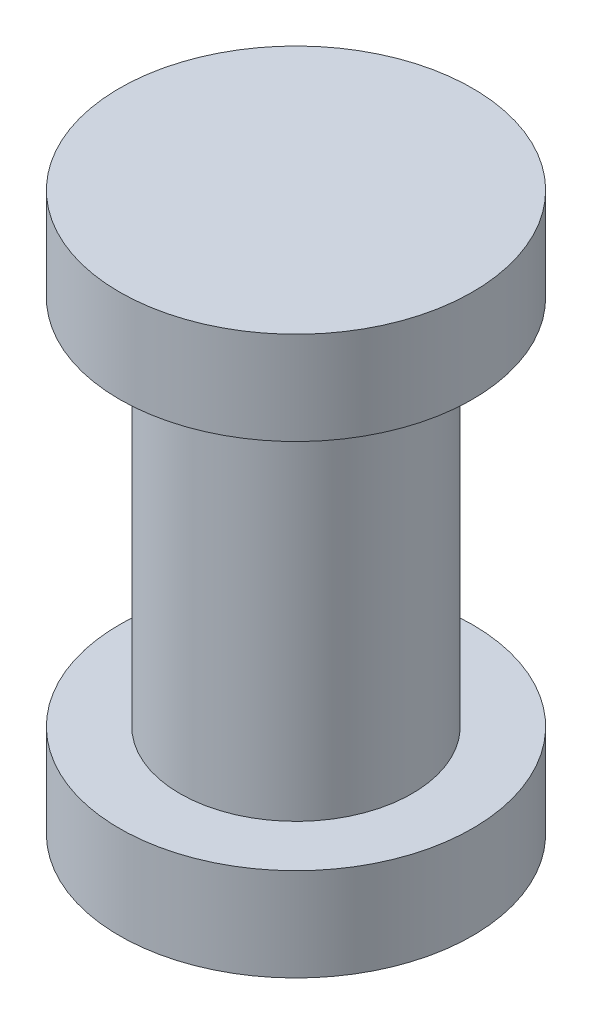
ISO-10303-21;
HEADER;
FILE_DESCRIPTION(('STEP AP214'),'2;1');
FILE_NAME('part.step','',(''),(''),'','','');
FILE_SCHEMA(('AUTOMOTIVE_DESIGN { 1 0 10303 214 1 1 1 1 }'));
ENDSEC;
DATA;
#1=APPLICATION_CONTEXT('core data for automotive mechanical design processes');
#2=APPLICATION_PROTOCOL_DEFINITION('international standard','automotive_design',2000,#1);
#3=PRODUCT_CONTEXT('',#1,'mechanical');
#4=PRODUCT('Part','Part','',(#3));
#5=PRODUCT_RELATED_PRODUCT_CATEGORY('part','',(#4));
#6=PRODUCT_DEFINITION_FORMATION('','',#4);
#7=PRODUCT_DEFINITION_CONTEXT('part definition',#1,'design');
#8=PRODUCT_DEFINITION('design','',#6,#7);
#9=PRODUCT_DEFINITION_SHAPE('','',#8);
#10=(LENGTH_UNIT() NAMED_UNIT(*) SI_UNIT(.MILLI.,.METRE.));
#11=(NAMED_UNIT(*) PLANE_ANGLE_UNIT() SI_UNIT($,.RADIAN.));
#12=(NAMED_UNIT(*) SI_UNIT($,.STERADIAN.) SOLID_ANGLE_UNIT());
#13=UNCERTAINTY_MEASURE_WITH_UNIT(LENGTH_MEASURE(1.E-05),#10,'distance_accuracy_value','');
#14=(GEOMETRIC_REPRESENTATION_CONTEXT(3) GLOBAL_UNCERTAINTY_ASSIGNED_CONTEXT((#13)) GLOBAL_UNIT_ASSIGNED_CONTEXT((#10,
#11,#12)) REPRESENTATION_CONTEXT('',''));
#15=CARTESIAN_POINT('',(0.,0.,0.));
#16=DIRECTION('',(0.,0.,1.));
#17=DIRECTION('',(1.,0.,0.));
#18=AXIS2_PLACEMENT_3D('',#15,#16,#17);
#19=CARTESIAN_POINT('',(0.,-60.,0.));
#20=DIRECTION('',(0.,1.,0.));
#21=DIRECTION('',(0.,0.,1.));
#22=AXIS2_PLACEMENT_3D('',#19,#20,#21);
#23=CYLINDRICAL_SURFACE('',#22,12.5);
#24=CARTESIAN_POINT('',(0.,-10.,0.));
#25=DIRECTION('',(0.,-1.,0.));
#26=DIRECTION('',(0.,0.,-1.));
#27=AXIS2_PLACEMENT_3D('',#24,#25,#26);
#28=CIRCLE('',#27,12.5);
#29=CARTESIAN_POINT('',(0.,-10.,-12.5));
#30=VERTEX_POINT('',#29);
#31=EDGE_CURVE('E45',#30,#30,#28,.T.);
#32=ORIENTED_EDGE('',*,*,#31,.T.);
#33=EDGE_LOOP('',(#32));
#34=FACE_BOUND('',#33,.T.);
#35=CARTESIAN_POINT('',(0.,-50.,0.));
#36=DIRECTION('',(0.,-1.,0.));
#37=DIRECTION('',(0.,0.,-1.));
#38=AXIS2_PLACEMENT_3D('',#35,#36,#37);
#39=CIRCLE('',#38,12.5);
#40=CARTESIAN_POINT('',(0.,-50.,-12.5));
#41=VERTEX_POINT('',#40);
#42=EDGE_CURVE('E10',#41,#41,#39,.T.);
#43=ORIENTED_EDGE('',*,*,#42,.F.);
#44=EDGE_LOOP('',(#43));
#45=FACE_BOUND('',#44,.T.);
#46=ADVANCED_FACE('F38',(#34,#45),#23,.T.);
#47=CARTESIAN_POINT('',(0.,-10.,0.));
#48=DIRECTION('',(0.,1.,0.));
#49=DIRECTION('',(0.,0.,1.));
#50=AXIS2_PLACEMENT_3D('',#47,#48,#49);
#51=CYLINDRICAL_SURFACE('',#50,19.);
#52=CARTESIAN_POINT('',(0.,-10.,0.));
#53=DIRECTION('',(0.,1.,0.));
#54=DIRECTION('',(0.,0.,1.));
#55=AXIS2_PLACEMENT_3D('',#52,#53,#54);
#56=CIRCLE('',#55,19.);
#57=CARTESIAN_POINT('',(0.,-10.,19.));
#58=VERTEX_POINT('',#57);
#59=EDGE_CURVE('E49',#58,#58,#56,.T.);
#60=ORIENTED_EDGE('',*,*,#59,.T.);
#61=EDGE_LOOP('',(#60));
#62=FACE_BOUND('',#61,.T.);
#63=CARTESIAN_POINT('',(0.,0.,0.));
#64=DIRECTION('',(0.,1.,0.));
#65=DIRECTION('',(0.,0.,1.));
#66=AXIS2_PLACEMENT_3D('',#63,#64,#65);
#67=CIRCLE('',#66,19.);
#68=CARTESIAN_POINT('',(0.,0.,19.));
#69=VERTEX_POINT('',#68);
#70=EDGE_CURVE('E54',#69,#69,#67,.T.);
#71=ORIENTED_EDGE('',*,*,#70,.F.);
#72=EDGE_LOOP('',(#71));
#73=FACE_BOUND('',#72,.T.);
#74=ADVANCED_FACE('F40',(#62,#73),#51,.T.);
#75=CARTESIAN_POINT('',(0.,-10.,0.));
#76=DIRECTION('',(0.,1.,0.));
#77=DIRECTION('',(0.,0.,1.));
#78=AXIS2_PLACEMENT_3D('',#75,#76,#77);
#79=PLANE('',#78);
#80=ORIENTED_EDGE('',*,*,#31,.F.);
#81=EDGE_LOOP('',(#80));
#82=FACE_BOUND('',#81,.T.);
#83=ORIENTED_EDGE('',*,*,#59,.F.);
#84=EDGE_LOOP('',(#83));
#85=FACE_BOUND('',#84,.T.);
#86=ADVANCED_FACE('F81',(#82,#85),#79,.F.);
#87=CARTESIAN_POINT('',(0.,0.,0.));
#88=DIRECTION('',(0.,1.,0.));
#89=DIRECTION('',(0.,0.,1.));
#90=AXIS2_PLACEMENT_3D('',#87,#88,#89);
#91=PLANE('',#90);
#92=ORIENTED_EDGE('',*,*,#70,.T.);
#93=EDGE_LOOP('',(#92));
#94=FACE_BOUND('',#93,.T.);
#95=ADVANCED_FACE('F74',(#94),#91,.T.);
#96=CARTESIAN_POINT('',(0.,-50.,0.));
#97=DIRECTION('',(0.,-1.,0.));
#98=DIRECTION('',(0.,0.,-1.));
#99=AXIS2_PLACEMENT_3D('',#96,#97,#98);
#100=CYLINDRICAL_SURFACE('',#99,19.);
#101=CARTESIAN_POINT('',(0.,-50.,0.));
#102=DIRECTION('',(0.,-1.,0.));
#103=DIRECTION('',(0.,0.,-1.));
#104=AXIS2_PLACEMENT_3D('',#101,#102,#103);
#105=CIRCLE('',#104,19.);
#106=CARTESIAN_POINT('',(0.,-50.,-19.));
#107=VERTEX_POINT('',#106);
#108=EDGE_CURVE('E60',#107,#107,#105,.T.);
#109=ORIENTED_EDGE('',*,*,#108,.T.);
#110=EDGE_LOOP('',(#109));
#111=FACE_BOUND('',#110,.T.);
#112=CARTESIAN_POINT('',(0.,-60.,0.));
#113=DIRECTION('',(0.,-1.,0.));
#114=DIRECTION('',(0.,0.,-1.));
#115=AXIS2_PLACEMENT_3D('',#112,#113,#114);
#116=CIRCLE('',#115,19.);
#117=CARTESIAN_POINT('',(0.,-60.,-19.));
#118=VERTEX_POINT('',#117);
#119=EDGE_CURVE('E57',#118,#118,#116,.T.);
#120=ORIENTED_EDGE('',*,*,#119,.F.);
#121=EDGE_LOOP('',(#120));
#122=FACE_BOUND('',#121,.T.);
#123=ADVANCED_FACE('F71',(#111,#122),#100,.T.);
#124=CARTESIAN_POINT('',(0.,-50.,0.));
#125=DIRECTION('',(0.,-1.,0.));
#126=DIRECTION('',(0.,0.,-1.));
#127=AXIS2_PLACEMENT_3D('',#124,#125,#126);
#128=PLANE('',#127);
#129=ORIENTED_EDGE('',*,*,#42,.T.);
#130=EDGE_LOOP('',(#129));
#131=FACE_BOUND('',#130,.T.);
#132=ORIENTED_EDGE('',*,*,#108,.F.);
#133=EDGE_LOOP('',(#132));
#134=FACE_BOUND('',#133,.T.);
#135=ADVANCED_FACE('F73',(#131,#134),#128,.F.);
#136=CARTESIAN_POINT('',(0.,-60.,0.));
#137=DIRECTION('',(0.,-1.,0.));
#138=DIRECTION('',(0.,0.,-1.));
#139=AXIS2_PLACEMENT_3D('',#136,#137,#138);
#140=PLANE('',#139);
#141=ORIENTED_EDGE('',*,*,#119,.T.);
#142=EDGE_LOOP('',(#141));
#143=FACE_BOUND('',#142,.T.);
#144=ADVANCED_FACE('F69',(#143),#140,.T.);
#145=CLOSED_SHELL('',(#46,#74,#86,#95,#123,#135,#144));
#146=MANIFOLD_SOLID_BREP('B2',#145);
#147=ADVANCED_BREP_SHAPE_REPRESENTATION('',(#18,#146),#14);
#148=SHAPE_DEFINITION_REPRESENTATION(#9,#147);
ENDSEC;
END-ISO-10303-21;
